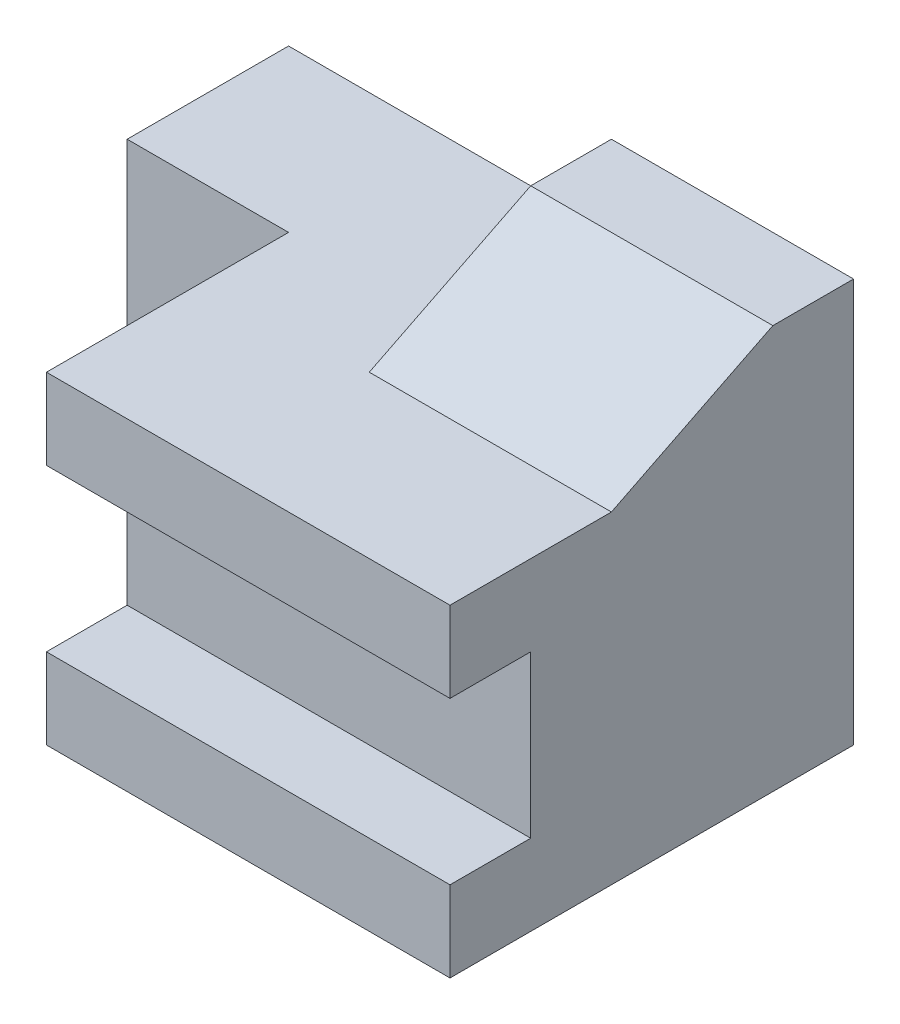
ISO-10303-21;
HEADER;
FILE_DESCRIPTION(('STEP AP214'),'2;1');
FILE_NAME('part.step','',(''),(''),'','','');
FILE_SCHEMA(('AUTOMOTIVE_DESIGN { 1 0 10303 214 1 1 1 1 }'));
ENDSEC;
DATA;
#1=APPLICATION_CONTEXT('core data for automotive mechanical design processes');
#2=APPLICATION_PROTOCOL_DEFINITION('international standard','automotive_design',2000,#1);
#3=PRODUCT_CONTEXT('',#1,'mechanical');
#4=PRODUCT('Part','Part','',(#3));
#5=PRODUCT_RELATED_PRODUCT_CATEGORY('part','',(#4));
#6=PRODUCT_DEFINITION_FORMATION('','',#4);
#7=PRODUCT_DEFINITION_CONTEXT('part definition',#1,'design');
#8=PRODUCT_DEFINITION('design','',#6,#7);
#9=PRODUCT_DEFINITION_SHAPE('','',#8);
#10=(LENGTH_UNIT() NAMED_UNIT(*) SI_UNIT(.MILLI.,.METRE.));
#11=(NAMED_UNIT(*) PLANE_ANGLE_UNIT() SI_UNIT($,.RADIAN.));
#12=(NAMED_UNIT(*) SI_UNIT($,.STERADIAN.) SOLID_ANGLE_UNIT());
#13=UNCERTAINTY_MEASURE_WITH_UNIT(LENGTH_MEASURE(1.E-05),#10,'distance_accuracy_value','');
#14=(GEOMETRIC_REPRESENTATION_CONTEXT(3) GLOBAL_UNCERTAINTY_ASSIGNED_CONTEXT((#13)) GLOBAL_UNIT_ASSIGNED_CONTEXT((#10,
#11,#12)) REPRESENTATION_CONTEXT('',''));
#15=CARTESIAN_POINT('',(0.,0.,0.));
#16=DIRECTION('',(0.,0.,1.));
#17=DIRECTION('',(1.,0.,0.));
#18=AXIS2_PLACEMENT_3D('',#15,#16,#17);
#19=CARTESIAN_POINT('',(0.,40.,50.));
#20=DIRECTION('',(0.,-1.,0.));
#21=DIRECTION('',(0.,0.,-1.));
#22=AXIS2_PLACEMENT_3D('',#19,#20,#21);
#23=PLANE('',#22);
#24=DIRECTION('',(1.,0.,0.));
#25=VECTOR('',#24,1.);
#26=CARTESIAN_POINT('',(70.,40.,30.));
#27=LINE('',#26,#25);
#28=CARTESIAN_POINT('',(40.,40.,30.));
#29=VERTEX_POINT('',#28);
#30=CARTESIAN_POINT('',(70.,40.,30.));
#31=VERTEX_POINT('',#30);
#32=EDGE_CURVE('E153',#29,#31,#27,.T.);
#33=ORIENTED_EDGE('',*,*,#32,.F.);
#34=DIRECTION('',(0.,0.,1.));
#35=VECTOR('',#34,1.);
#36=CARTESIAN_POINT('',(40.,40.,0.));
#37=LINE('',#36,#35);
#38=CARTESIAN_POINT('',(40.,40.,0.));
#39=VERTEX_POINT('',#38);
#40=EDGE_CURVE('E55',#39,#29,#37,.T.);
#41=ORIENTED_EDGE('',*,*,#40,.F.);
#42=DIRECTION('',(-1.,0.,0.));
#43=VECTOR('',#42,1.);
#44=CARTESIAN_POINT('',(0.,40.,0.));
#45=LINE('',#44,#43);
#46=CARTESIAN_POINT('',(0.,40.,0.));
#47=VERTEX_POINT('',#46);
#48=EDGE_CURVE('E160',#39,#47,#45,.T.);
#49=ORIENTED_EDGE('',*,*,#48,.T.);
#50=DIRECTION('',(0.,0.,-1.));
#51=VECTOR('',#50,1.);
#52=CARTESIAN_POINT('',(0.,40.,50.));
#53=LINE('',#52,#51);
#54=CARTESIAN_POINT('',(0.,40.,20.));
#55=VERTEX_POINT('',#54);
#56=EDGE_CURVE('E172',#55,#47,#53,.T.);
#57=ORIENTED_EDGE('',*,*,#56,.F.);
#58=DIRECTION('',(-1.,0.,0.));
#59=VECTOR('',#58,1.);
#60=CARTESIAN_POINT('',(0.,40.,20.));
#61=LINE('',#60,#59);
#62=CARTESIAN_POINT('',(20.,40.,20.));
#63=VERTEX_POINT('',#62);
#64=EDGE_CURVE('E235',#63,#55,#61,.T.);
#65=ORIENTED_EDGE('',*,*,#64,.F.);
#66=DIRECTION('',(0.,0.,-1.));
#67=VECTOR('',#66,1.);
#68=CARTESIAN_POINT('',(20.,40.,50.));
#69=LINE('',#68,#67);
#70=CARTESIAN_POINT('',(20.,40.,50.));
#71=VERTEX_POINT('',#70);
#72=EDGE_CURVE('E239',#71,#63,#69,.T.);
#73=ORIENTED_EDGE('',*,*,#72,.F.);
#74=DIRECTION('',(-1.,0.,0.));
#75=VECTOR('',#74,1.);
#76=CARTESIAN_POINT('',(0.,40.,50.));
#77=LINE('',#76,#75);
#78=CARTESIAN_POINT('',(70.,40.,50.));
#79=VERTEX_POINT('',#78);
#80=EDGE_CURVE('E174',#79,#71,#77,.T.);
#81=ORIENTED_EDGE('',*,*,#80,.F.);
#82=DIRECTION('',(0.,0.,-1.));
#83=VECTOR('',#82,1.);
#84=CARTESIAN_POINT('',(70.,40.,50.));
#85=LINE('',#84,#83);
#86=EDGE_CURVE('E165',#79,#31,#85,.T.);
#87=ORIENTED_EDGE('',*,*,#86,.T.);
#88=EDGE_LOOP('',(#33,#41,#49,#57,#65,#73,#81,#87));
#89=FACE_BOUND('',#88,.T.);
#90=ADVANCED_FACE('F33',(#89),#23,.F.);
#91=CARTESIAN_POINT('',(0.,0.,50.));
#92=DIRECTION('',(0.,0.,-1.));
#93=DIRECTION('',(-1.,0.,0.));
#94=AXIS2_PLACEMENT_3D('',#91,#92,#93);
#95=PLANE('',#94);
#96=DIRECTION('',(0.,1.,0.));
#97=VECTOR('',#96,1.);
#98=CARTESIAN_POINT('',(70.,0.,50.));
#99=LINE('',#98,#97);
#100=CARTESIAN_POINT('',(70.,0.,50.));
#101=VERTEX_POINT('',#100);
#102=CARTESIAN_POINT('',(70.,10.,50.));
#103=VERTEX_POINT('',#102);
#104=EDGE_CURVE('E212',#101,#103,#99,.T.);
#105=ORIENTED_EDGE('',*,*,#104,.T.);
#106=DIRECTION('',(-1.,0.,0.));
#107=VECTOR('',#106,1.);
#108=CARTESIAN_POINT('',(70.,10.,50.));
#109=LINE('',#108,#107);
#110=CARTESIAN_POINT('',(20.,10.,50.));
#111=VERTEX_POINT('',#110);
#112=EDGE_CURVE('E194',#103,#111,#109,.T.);
#113=ORIENTED_EDGE('',*,*,#112,.T.);
#114=DIRECTION('',(0.,-1.,0.));
#115=VECTOR('',#114,1.);
#116=CARTESIAN_POINT('',(20.,0.,50.));
#117=LINE('',#116,#115);
#118=CARTESIAN_POINT('',(20.,0.,50.));
#119=VERTEX_POINT('',#118);
#120=EDGE_CURVE('E181',#111,#119,#117,.T.);
#121=ORIENTED_EDGE('',*,*,#120,.T.);
#122=DIRECTION('',(1.,0.,0.));
#123=VECTOR('',#122,1.);
#124=CARTESIAN_POINT('',(0.,0.,50.));
#125=LINE('',#124,#123);
#126=EDGE_CURVE('E163',#119,#101,#125,.T.);
#127=ORIENTED_EDGE('',*,*,#126,.T.);
#128=EDGE_LOOP('',(#105,#113,#121,#127));
#129=FACE_BOUND('',#128,.T.);
#130=ADVANCED_FACE('F191',(#129),#95,.F.);
#131=CARTESIAN_POINT('',(0.,0.,50.));
#132=DIRECTION('',(1.,0.,0.));
#133=DIRECTION('',(0.,0.,-1.));
#134=AXIS2_PLACEMENT_3D('',#131,#132,#133);
#135=PLANE('',#134);
#136=DIRECTION('',(0.,0.,-1.));
#137=VECTOR('',#136,1.);
#138=CARTESIAN_POINT('',(0.,0.,50.));
#139=LINE('',#138,#137);
#140=CARTESIAN_POINT('',(0.,0.,20.));
#141=VERTEX_POINT('',#140);
#142=CARTESIAN_POINT('',(0.,0.,0.));
#143=VERTEX_POINT('',#142);
#144=EDGE_CURVE('E180',#141,#143,#139,.T.);
#145=ORIENTED_EDGE('',*,*,#144,.F.);
#146=DIRECTION('',(0.,1.,0.));
#147=VECTOR('',#146,1.);
#148=CARTESIAN_POINT('',(0.,-10.,20.));
#149=LINE('',#148,#147);
#150=EDGE_CURVE('E206',#141,#55,#149,.T.);
#151=ORIENTED_EDGE('',*,*,#150,.T.);
#152=ORIENTED_EDGE('',*,*,#56,.T.);
#153=DIRECTION('',(0.,-1.,0.));
#154=VECTOR('',#153,1.);
#155=CARTESIAN_POINT('',(0.,0.,0.));
#156=LINE('',#155,#154);
#157=EDGE_CURVE('E217',#47,#143,#156,.T.);
#158=ORIENTED_EDGE('',*,*,#157,.T.);
#159=EDGE_LOOP('',(#145,#151,#152,#158));
#160=FACE_BOUND('',#159,.T.);
#161=ADVANCED_FACE('F35',(#160),#135,.F.);
#162=CARTESIAN_POINT('',(0.,0.,50.));
#163=DIRECTION('',(0.,1.,0.));
#164=DIRECTION('',(0.,0.,1.));
#165=AXIS2_PLACEMENT_3D('',#162,#163,#164);
#166=PLANE('',#165);
#167=DIRECTION('',(0.,0.,-1.));
#168=VECTOR('',#167,1.);
#169=CARTESIAN_POINT('',(20.,0.,50.));
#170=LINE('',#169,#168);
#171=CARTESIAN_POINT('',(20.,0.,20.));
#172=VERTEX_POINT('',#171);
#173=EDGE_CURVE('E199',#119,#172,#170,.T.);
#174=ORIENTED_EDGE('',*,*,#173,.T.);
#175=DIRECTION('',(-1.,0.,0.));
#176=VECTOR('',#175,1.);
#177=CARTESIAN_POINT('',(0.,0.,20.));
#178=LINE('',#177,#176);
#179=EDGE_CURVE('E205',#172,#141,#178,.T.);
#180=ORIENTED_EDGE('',*,*,#179,.T.);
#181=ORIENTED_EDGE('',*,*,#144,.T.);
#182=DIRECTION('',(1.,0.,0.));
#183=VECTOR('',#182,1.);
#184=CARTESIAN_POINT('',(0.,0.,0.));
#185=LINE('',#184,#183);
#186=CARTESIAN_POINT('',(70.,0.,0.));
#187=VERTEX_POINT('',#186);
#188=EDGE_CURVE('E219',#143,#187,#185,.T.);
#189=ORIENTED_EDGE('',*,*,#188,.T.);
#190=DIRECTION('',(0.,0.,-1.));
#191=VECTOR('',#190,1.);
#192=CARTESIAN_POINT('',(70.,0.,50.));
#193=LINE('',#192,#191);
#194=EDGE_CURVE('E177',#101,#187,#193,.T.);
#195=ORIENTED_EDGE('',*,*,#194,.F.);
#196=ORIENTED_EDGE('',*,*,#126,.F.);
#197=EDGE_LOOP('',(#174,#180,#181,#189,#195,#196));
#198=FACE_BOUND('',#197,.T.);
#199=ADVANCED_FACE('F208',(#198),#166,.F.);
#200=CARTESIAN_POINT('',(70.,0.,50.));
#201=DIRECTION('',(-1.,0.,0.));
#202=DIRECTION('',(0.,0.,1.));
#203=AXIS2_PLACEMENT_3D('',#200,#201,#202);
#204=PLANE('',#203);
#205=DIRECTION('',(0.,0.,-1.));
#206=VECTOR('',#205,1.);
#207=CARTESIAN_POINT('',(70.,50.,0.));
#208=LINE('',#207,#206);
#209=CARTESIAN_POINT('',(70.,50.,10.));
#210=VERTEX_POINT('',#209);
#211=CARTESIAN_POINT('',(70.,50.,0.));
#212=VERTEX_POINT('',#211);
#213=EDGE_CURVE('E145',#210,#212,#208,.T.);
#214=ORIENTED_EDGE('',*,*,#213,.F.);
#215=DIRECTION('',(0.,-0.447213595499958,0.894427190999916));
#216=VECTOR('',#215,1.);
#217=CARTESIAN_POINT('',(70.,24.,62.));
#218=LINE('',#217,#216);
#219=EDGE_CURVE('E48',#210,#31,#218,.T.);
#220=ORIENTED_EDGE('',*,*,#219,.T.);
#221=ORIENTED_EDGE('',*,*,#86,.F.);
#222=CARTESIAN_POINT('',(70.,30.,50.));
#223=VERTEX_POINT('',#222);
#224=EDGE_CURVE('E210',#223,#79,#99,.T.);
#225=ORIENTED_EDGE('',*,*,#224,.F.);
#226=DIRECTION('',(0.,0.,-1.));
#227=VECTOR('',#226,1.);
#228=CARTESIAN_POINT('',(70.,30.,50.));
#229=LINE('',#228,#227);
#230=CARTESIAN_POINT('',(70.,30.,40.));
#231=VERTEX_POINT('',#230);
#232=EDGE_CURVE('E151',#223,#231,#229,.T.);
#233=ORIENTED_EDGE('',*,*,#232,.T.);
#234=DIRECTION('',(0.,-1.,0.));
#235=VECTOR('',#234,1.);
#236=CARTESIAN_POINT('',(70.,30.,40.));
#237=LINE('',#236,#235);
#238=CARTESIAN_POINT('',(70.,10.,40.));
#239=VERTEX_POINT('',#238);
#240=EDGE_CURVE('E257',#231,#239,#237,.T.);
#241=ORIENTED_EDGE('',*,*,#240,.T.);
#242=DIRECTION('',(0.,0.,1.));
#243=VECTOR('',#242,1.);
#244=CARTESIAN_POINT('',(70.,10.,50.));
#245=LINE('',#244,#243);
#246=EDGE_CURVE('E244',#239,#103,#245,.T.);
#247=ORIENTED_EDGE('',*,*,#246,.T.);
#248=ORIENTED_EDGE('',*,*,#104,.F.);
#249=ORIENTED_EDGE('',*,*,#194,.T.);
#250=DIRECTION('',(0.,1.,0.));
#251=VECTOR('',#250,1.);
#252=CARTESIAN_POINT('',(70.,0.,0.));
#253=LINE('',#252,#251);
#254=EDGE_CURVE('E164',#187,#212,#253,.T.);
#255=ORIENTED_EDGE('',*,*,#254,.T.);
#256=EDGE_LOOP('',(#214,#220,#221,#225,#233,#241,#247,#248,#249,#255));
#257=FACE_BOUND('',#256,.T.);
#258=ADVANCED_FACE('F224',(#257),#204,.F.);
#259=CARTESIAN_POINT('',(20.,30.,50.));
#260=VERTEX_POINT('',#259);
#261=EDGE_CURVE('E41',#71,#260,#117,.T.);
#262=ORIENTED_EDGE('',*,*,#261,.T.);
#263=DIRECTION('',(-1.,0.,0.));
#264=VECTOR('',#263,1.);
#265=CARTESIAN_POINT('',(70.,30.,50.));
#266=LINE('',#265,#264);
#267=EDGE_CURVE('E241',#223,#260,#266,.T.);
#268=ORIENTED_EDGE('',*,*,#267,.F.);
#269=ORIENTED_EDGE('',*,*,#224,.T.);
#270=ORIENTED_EDGE('',*,*,#80,.T.);
#271=EDGE_LOOP('',(#262,#268,#269,#270));
#272=FACE_BOUND('',#271,.T.);
#273=ADVANCED_FACE('F266',(#272),#95,.F.);
#274=CARTESIAN_POINT('',(0.,0.,0.));
#275=DIRECTION('',(0.,0.,-1.));
#276=DIRECTION('',(-1.,0.,0.));
#277=AXIS2_PLACEMENT_3D('',#274,#275,#276);
#278=PLANE('',#277);
#279=ORIENTED_EDGE('',*,*,#157,.F.);
#280=ORIENTED_EDGE('',*,*,#48,.F.);
#281=DIRECTION('',(0.,-1.,0.));
#282=VECTOR('',#281,1.);
#283=CARTESIAN_POINT('',(40.,50.,0.));
#284=LINE('',#283,#282);
#285=CARTESIAN_POINT('',(40.,50.,0.));
#286=VERTEX_POINT('',#285);
#287=EDGE_CURVE('E141',#286,#39,#284,.T.);
#288=ORIENTED_EDGE('',*,*,#287,.F.);
#289=DIRECTION('',(-1.,0.,0.));
#290=VECTOR('',#289,1.);
#291=CARTESIAN_POINT('',(70.,50.,0.));
#292=LINE('',#291,#290);
#293=EDGE_CURVE('E139',#212,#286,#292,.T.);
#294=ORIENTED_EDGE('',*,*,#293,.F.);
#295=ORIENTED_EDGE('',*,*,#254,.F.);
#296=ORIENTED_EDGE('',*,*,#188,.F.);
#297=EDGE_LOOP('',(#279,#280,#288,#294,#295,#296));
#298=FACE_BOUND('',#297,.T.);
#299=ADVANCED_FACE('F227',(#298),#278,.T.);
#300=CARTESIAN_POINT('',(0.,-10.,20.));
#301=DIRECTION('',(0.,0.,-1.));
#302=DIRECTION('',(-1.,0.,0.));
#303=AXIS2_PLACEMENT_3D('',#300,#301,#302);
#304=PLANE('',#303);
#305=DIRECTION('',(0.,1.,0.));
#306=VECTOR('',#305,1.);
#307=CARTESIAN_POINT('',(20.,-10.,20.));
#308=LINE('',#307,#306);
#309=EDGE_CURVE('E202',#172,#63,#308,.T.);
#310=ORIENTED_EDGE('',*,*,#309,.T.);
#311=ORIENTED_EDGE('',*,*,#64,.T.);
#312=ORIENTED_EDGE('',*,*,#150,.F.);
#313=ORIENTED_EDGE('',*,*,#179,.F.);
#314=EDGE_LOOP('',(#310,#311,#312,#313));
#315=FACE_BOUND('',#314,.T.);
#316=ADVANCED_FACE('F283',(#315),#304,.F.);
#317=CARTESIAN_POINT('',(20.,-10.,50.));
#318=DIRECTION('',(1.,0.,0.));
#319=DIRECTION('',(0.,0.,-1.));
#320=AXIS2_PLACEMENT_3D('',#317,#318,#319);
#321=PLANE('',#320);
#322=ORIENTED_EDGE('',*,*,#120,.F.);
#323=DIRECTION('',(0.,0.,1.));
#324=VECTOR('',#323,1.);
#325=CARTESIAN_POINT('',(20.,10.,50.));
#326=LINE('',#325,#324);
#327=CARTESIAN_POINT('',(20.,10.,40.));
#328=VERTEX_POINT('',#327);
#329=EDGE_CURVE('E249',#328,#111,#326,.T.);
#330=ORIENTED_EDGE('',*,*,#329,.F.);
#331=DIRECTION('',(0.,-1.,0.));
#332=VECTOR('',#331,1.);
#333=CARTESIAN_POINT('',(20.,30.,40.));
#334=LINE('',#333,#332);
#335=CARTESIAN_POINT('',(20.,30.,40.));
#336=VERTEX_POINT('',#335);
#337=EDGE_CURVE('E251',#336,#328,#334,.T.);
#338=ORIENTED_EDGE('',*,*,#337,.F.);
#339=DIRECTION('',(0.,0.,-1.));
#340=VECTOR('',#339,1.);
#341=CARTESIAN_POINT('',(20.,30.,50.));
#342=LINE('',#341,#340);
#343=EDGE_CURVE('E143',#260,#336,#342,.T.);
#344=ORIENTED_EDGE('',*,*,#343,.F.);
#345=ORIENTED_EDGE('',*,*,#261,.F.);
#346=ORIENTED_EDGE('',*,*,#72,.T.);
#347=ORIENTED_EDGE('',*,*,#309,.F.);
#348=ORIENTED_EDGE('',*,*,#173,.F.);
#349=EDGE_LOOP('',(#322,#330,#338,#344,#345,#346,#347,#348));
#350=FACE_BOUND('',#349,.T.);
#351=ADVANCED_FACE('F200',(#350),#321,.F.);
#352=CARTESIAN_POINT('',(70.,10.,50.));
#353=DIRECTION('',(0.,-1.,0.));
#354=DIRECTION('',(0.,0.,-1.));
#355=AXIS2_PLACEMENT_3D('',#352,#353,#354);
#356=PLANE('',#355);
#357=ORIENTED_EDGE('',*,*,#329,.T.);
#358=ORIENTED_EDGE('',*,*,#112,.F.);
#359=ORIENTED_EDGE('',*,*,#246,.F.);
#360=DIRECTION('',(-1.,0.,0.));
#361=VECTOR('',#360,1.);
#362=CARTESIAN_POINT('',(70.,10.,40.));
#363=LINE('',#362,#361);
#364=EDGE_CURVE('E246',#239,#328,#363,.T.);
#365=ORIENTED_EDGE('',*,*,#364,.T.);
#366=EDGE_LOOP('',(#357,#358,#359,#365));
#367=FACE_BOUND('',#366,.T.);
#368=ADVANCED_FACE('F275',(#367),#356,.F.);
#369=CARTESIAN_POINT('',(70.,30.,40.));
#370=DIRECTION('',(0.,0.,-1.));
#371=DIRECTION('',(-1.,0.,0.));
#372=AXIS2_PLACEMENT_3D('',#369,#370,#371);
#373=PLANE('',#372);
#374=ORIENTED_EDGE('',*,*,#337,.T.);
#375=ORIENTED_EDGE('',*,*,#364,.F.);
#376=ORIENTED_EDGE('',*,*,#240,.F.);
#377=DIRECTION('',(-1.,0.,0.));
#378=VECTOR('',#377,1.);
#379=CARTESIAN_POINT('',(70.,30.,40.));
#380=LINE('',#379,#378);
#381=EDGE_CURVE('E243',#231,#336,#380,.T.);
#382=ORIENTED_EDGE('',*,*,#381,.T.);
#383=EDGE_LOOP('',(#374,#375,#376,#382));
#384=FACE_BOUND('',#383,.T.);
#385=ADVANCED_FACE('F272',(#384),#373,.F.);
#386=CARTESIAN_POINT('',(70.,30.,50.));
#387=DIRECTION('',(0.,1.,0.));
#388=DIRECTION('',(0.,0.,1.));
#389=AXIS2_PLACEMENT_3D('',#386,#387,#388);
#390=PLANE('',#389);
#391=ORIENTED_EDGE('',*,*,#343,.T.);
#392=ORIENTED_EDGE('',*,*,#381,.F.);
#393=ORIENTED_EDGE('',*,*,#232,.F.);
#394=ORIENTED_EDGE('',*,*,#267,.T.);
#395=EDGE_LOOP('',(#391,#392,#393,#394));
#396=FACE_BOUND('',#395,.T.);
#397=ADVANCED_FACE('F264',(#396),#390,.F.);
#398=CARTESIAN_POINT('',(40.,50.,0.));
#399=DIRECTION('',(1.,0.,0.));
#400=DIRECTION('',(0.,0.,-1.));
#401=AXIS2_PLACEMENT_3D('',#398,#399,#400);
#402=PLANE('',#401);
#403=ORIENTED_EDGE('',*,*,#40,.T.);
#404=DIRECTION('',(0.,-0.447213595499958,0.894427190999916));
#405=VECTOR('',#404,1.);
#406=CARTESIAN_POINT('',(40.,50.,10.));
#407=LINE('',#406,#405);
#408=CARTESIAN_POINT('',(40.,50.,10.));
#409=VERTEX_POINT('',#408);
#410=EDGE_CURVE('E127',#409,#29,#407,.T.);
#411=ORIENTED_EDGE('',*,*,#410,.F.);
#412=DIRECTION('',(0.,0.,1.));
#413=VECTOR('',#412,1.);
#414=CARTESIAN_POINT('',(40.,50.,0.));
#415=LINE('',#414,#413);
#416=EDGE_CURVE('E135',#286,#409,#415,.T.);
#417=ORIENTED_EDGE('',*,*,#416,.F.);
#418=ORIENTED_EDGE('',*,*,#287,.T.);
#419=EDGE_LOOP('',(#403,#411,#417,#418));
#420=FACE_BOUND('',#419,.T.);
#421=ADVANCED_FACE('F133',(#420),#402,.F.);
#422=CARTESIAN_POINT('',(0.,50.,0.));
#423=DIRECTION('',(0.,-1.,0.));
#424=DIRECTION('',(0.,0.,-1.));
#425=AXIS2_PLACEMENT_3D('',#422,#423,#424);
#426=PLANE('',#425);
#427=ORIENTED_EDGE('',*,*,#416,.T.);
#428=DIRECTION('',(1.,0.,0.));
#429=VECTOR('',#428,1.);
#430=CARTESIAN_POINT('',(0.,50.,10.));
#431=LINE('',#430,#429);
#432=EDGE_CURVE('E11',#409,#210,#431,.T.);
#433=ORIENTED_EDGE('',*,*,#432,.T.);
#434=ORIENTED_EDGE('',*,*,#213,.T.);
#435=ORIENTED_EDGE('',*,*,#293,.T.);
#436=EDGE_LOOP('',(#427,#433,#434,#435));
#437=FACE_BOUND('',#436,.T.);
#438=ADVANCED_FACE('F137',(#437),#426,.F.);
#439=CARTESIAN_POINT('',(96.,50.,10.));
#440=DIRECTION('',(0.,-0.894427190999916,-0.447213595499958));
#441=DIRECTION('',(0.,0.447213595499958,-0.894427190999916));
#442=AXIS2_PLACEMENT_3D('',#439,#440,#441);
#443=PLANE('',#442);
#444=ORIENTED_EDGE('',*,*,#432,.F.);
#445=ORIENTED_EDGE('',*,*,#410,.T.);
#446=ORIENTED_EDGE('',*,*,#32,.T.);
#447=ORIENTED_EDGE('',*,*,#219,.F.);
#448=EDGE_LOOP('',(#444,#445,#446,#447));
#449=FACE_BOUND('',#448,.T.);
#450=ADVANCED_FACE('F126',(#449),#443,.F.);
#451=CLOSED_SHELL('',(#90,#130,#161,#199,#258,#273,#299,#316,#351,#368,#385,#397,#421,#438,#450));
#452=MANIFOLD_SOLID_BREP('B2',#451);
#453=ADVANCED_BREP_SHAPE_REPRESENTATION('',(#18,#452),#14);
#454=SHAPE_DEFINITION_REPRESENTATION(#9,#453);
ENDSEC;
END-ISO-10303-21;
